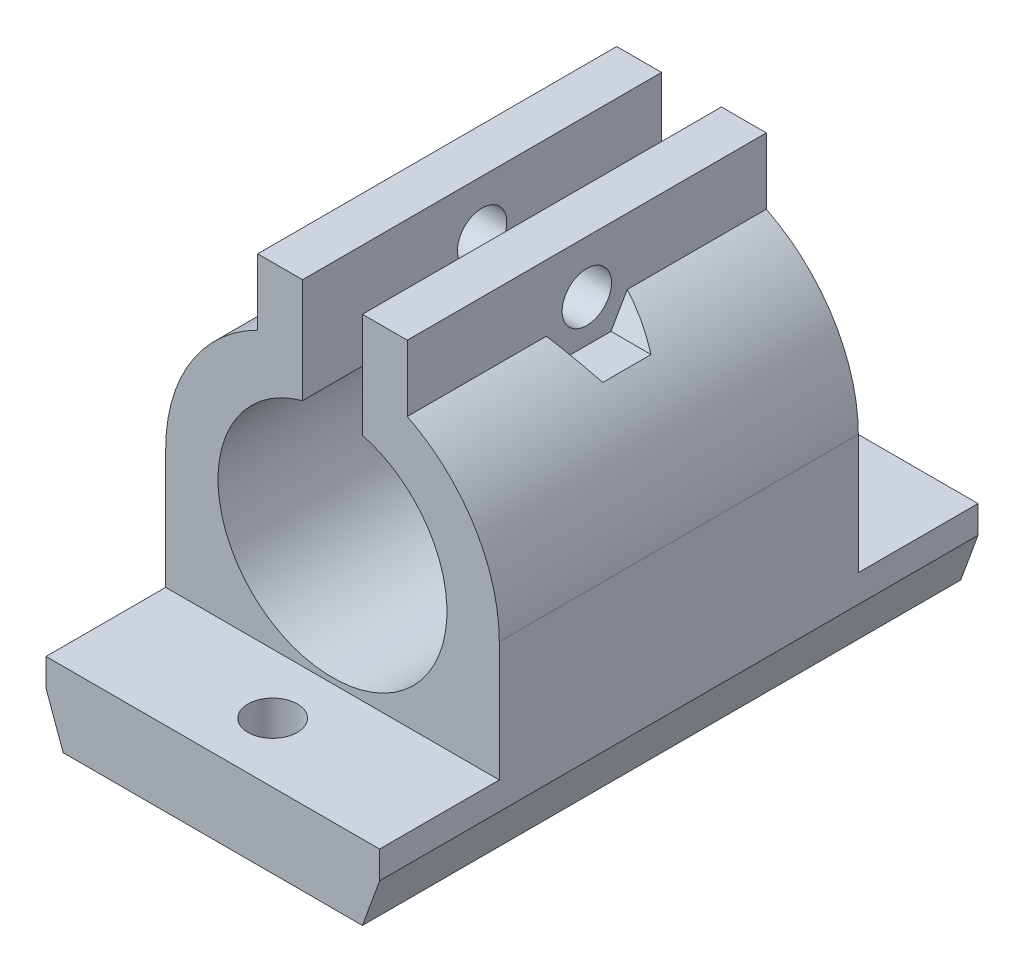
ISO-10303-21;
HEADER;
FILE_DESCRIPTION(('STEP AP214'),'2;1');
FILE_NAME('part.step','',(''),(''),'','','');
FILE_SCHEMA(('AUTOMOTIVE_DESIGN { 1 0 10303 214 1 1 1 1 }'));
ENDSEC;
DATA;
#1=APPLICATION_CONTEXT('core data for automotive mechanical design processes');
#2=APPLICATION_PROTOCOL_DEFINITION('international standard','automotive_design',2000,#1);
#3=PRODUCT_CONTEXT('',#1,'mechanical');
#4=PRODUCT('Part','Part','',(#3));
#5=PRODUCT_RELATED_PRODUCT_CATEGORY('part','',(#4));
#6=PRODUCT_DEFINITION_FORMATION('','',#4);
#7=PRODUCT_DEFINITION_CONTEXT('part definition',#1,'design');
#8=PRODUCT_DEFINITION('design','',#6,#7);
#9=PRODUCT_DEFINITION_SHAPE('','',#8);
#10=(LENGTH_UNIT() NAMED_UNIT(*) SI_UNIT(.MILLI.,.METRE.));
#11=(NAMED_UNIT(*) PLANE_ANGLE_UNIT() SI_UNIT($,.RADIAN.));
#12=(NAMED_UNIT(*) SI_UNIT($,.STERADIAN.) SOLID_ANGLE_UNIT());
#13=UNCERTAINTY_MEASURE_WITH_UNIT(LENGTH_MEASURE(1.E-05),#10,'distance_accuracy_value','');
#14=(GEOMETRIC_REPRESENTATION_CONTEXT(3) GLOBAL_UNCERTAINTY_ASSIGNED_CONTEXT((#13)) GLOBAL_UNIT_ASSIGNED_CONTEXT((#10,
#11,#12)) REPRESENTATION_CONTEXT('',''));
#15=CARTESIAN_POINT('',(0.,0.,0.));
#16=DIRECTION('',(0.,0.,1.));
#17=DIRECTION('',(1.,0.,0.));
#18=AXIS2_PLACEMENT_3D('',#15,#16,#17);
#19=CARTESIAN_POINT('',(0.,0.,40.));
#20=DIRECTION('',(0.,0.,-1.));
#21=DIRECTION('',(-1.,0.,0.));
#22=AXIS2_PLACEMENT_3D('',#19,#20,#21);
#23=CYLINDRICAL_SURFACE('',#22,11.15);
#24=CARTESIAN_POINT('',(0.,0.,23.0506814477178));
#25=DIRECTION('',(0.,0.5,0.866025403784439));
#26=DIRECTION('',(0.,0.866025403784439,-0.5));
#27=AXIS2_PLACEMENT_3D('',#24,#25,#26);
#28=ELLIPSE('',#27,12.8749110029287,11.15);
#29=CARTESIAN_POINT('',(7.67935483154562,8.08393526515502,18.383419246269));
#30=VERTEX_POINT('',#29);
#31=CARTESIAN_POINT('',(5.,9.96606742903138,17.2967697348046));
#32=VERTEX_POINT('',#31);
#33=EDGE_CURVE('E216',#30,#32,#28,.T.);
#34=ORIENTED_EDGE('',*,*,#33,.F.);
#35=DIRECTION('',(0.,0.,-1.));
#36=VECTOR('',#35,1.);
#37=CARTESIAN_POINT('',(7.67935483154562,8.08393526515502,40.));
#38=LINE('',#37,#36);
#39=CARTESIAN_POINT('',(7.67935483154562,8.08393526515502,21.616580753731));
#40=VERTEX_POINT('',#39);
#41=EDGE_CURVE('E367',#40,#30,#38,.T.);
#42=ORIENTED_EDGE('',*,*,#41,.F.);
#43=CARTESIAN_POINT('',(0.,0.,16.9493185522822));
#44=DIRECTION('',(0.,0.5,-0.866025403784439));
#45=DIRECTION('',(0.,-0.866025403784439,-0.5));
#46=AXIS2_PLACEMENT_3D('',#43,#44,#45);
#47=ELLIPSE('',#46,12.8749110029287,11.15);
#48=CARTESIAN_POINT('',(5.,9.96606742903137,22.7032302651954));
#49=VERTEX_POINT('',#48);
#50=EDGE_CURVE('E190',#49,#40,#47,.T.);
#51=ORIENTED_EDGE('',*,*,#50,.F.);
#52=DIRECTION('',(0.,0.,-1.));
#53=VECTOR('',#52,1.);
#54=CARTESIAN_POINT('',(5.,9.96606742903138,40.));
#55=LINE('',#54,#53);
#56=CARTESIAN_POINT('',(5.,9.96606742903138,32.));
#57=VERTEX_POINT('',#56);
#58=EDGE_CURVE('E206',#57,#49,#55,.T.);
#59=ORIENTED_EDGE('',*,*,#58,.F.);
#60=CARTESIAN_POINT('',(0.,0.,32.));
#61=DIRECTION('',(0.,0.,-1.));
#62=DIRECTION('',(-1.,0.,0.));
#63=AXIS2_PLACEMENT_3D('',#60,#61,#62);
#64=CIRCLE('',#63,11.15);
#65=CARTESIAN_POINT('',(11.15,0.,32.));
#66=VERTEX_POINT('',#65);
#67=EDGE_CURVE('E270',#57,#66,#64,.T.);
#68=ORIENTED_EDGE('',*,*,#67,.T.);
#69=DIRECTION('',(0.,0.,-1.));
#70=VECTOR('',#69,1.);
#71=CARTESIAN_POINT('',(11.15,0.,40.));
#72=LINE('',#71,#70);
#73=CARTESIAN_POINT('',(11.15,0.,8.));
#74=VERTEX_POINT('',#73);
#75=EDGE_CURVE('E338',#66,#74,#72,.T.);
#76=ORIENTED_EDGE('',*,*,#75,.T.);
#77=CARTESIAN_POINT('',(0.,0.,8.));
#78=DIRECTION('',(0.,0.,1.));
#79=DIRECTION('',(1.,0.,0.));
#80=AXIS2_PLACEMENT_3D('',#77,#78,#79);
#81=CIRCLE('',#80,11.15);
#82=CARTESIAN_POINT('',(5.,9.96606742903138,8.));
#83=VERTEX_POINT('',#82);
#84=EDGE_CURVE('E309',#74,#83,#81,.T.);
#85=ORIENTED_EDGE('',*,*,#84,.T.);
#86=EDGE_CURVE('E336',#32,#83,#55,.T.);
#87=ORIENTED_EDGE('',*,*,#86,.F.);
#88=EDGE_LOOP('',(#34,#42,#51,#59,#68,#76,#85,#87));
#89=FACE_BOUND('',#88,.T.);
#90=ADVANCED_FACE('F35',(#89),#23,.T.);
#91=CARTESIAN_POINT('',(11.15,10.883935265155,20.));
#92=DIRECTION('',(-1.,0.,0.));
#93=DIRECTION('',(0.,-1.,0.));
#94=AXIS2_PLACEMENT_3D('',#91,#92,#93);
#95=CYLINDRICAL_SURFACE('',#94,1.65);
#96=CARTESIAN_POINT('',(2.,10.883935265155,20.));
#97=DIRECTION('',(1.,0.,0.));
#98=DIRECTION('',(0.,1.,0.));
#99=AXIS2_PLACEMENT_3D('',#96,#97,#98);
#100=CIRCLE('',#99,1.65);
#101=CARTESIAN_POINT('',(2.,12.533935265155,20.));
#102=VERTEX_POINT('',#101);
#103=EDGE_CURVE('E221',#102,#102,#100,.T.);
#104=ORIENTED_EDGE('',*,*,#103,.F.);
#105=EDGE_LOOP('',(#104));
#106=FACE_BOUND('',#105,.T.);
#107=CARTESIAN_POINT('',(5.,10.883935265155,20.));
#108=DIRECTION('',(-1.,0.,0.));
#109=DIRECTION('',(0.,-1.,0.));
#110=AXIS2_PLACEMENT_3D('',#107,#108,#109);
#111=CIRCLE('',#110,1.65);
#112=CARTESIAN_POINT('',(5.,9.23393526515502,20.));
#113=VERTEX_POINT('',#112);
#114=EDGE_CURVE('E222',#113,#113,#111,.T.);
#115=ORIENTED_EDGE('',*,*,#114,.F.);
#116=EDGE_LOOP('',(#115));
#117=FACE_BOUND('',#116,.T.);
#118=ADVANCED_FACE('F387',(#106,#117),#95,.F.);
#119=CARTESIAN_POINT('',(0.,0.,40.));
#120=DIRECTION('',(0.,0.,-1.));
#121=DIRECTION('',(-1.,0.,0.));
#122=AXIS2_PLACEMENT_3D('',#119,#120,#121);
#123=CYLINDRICAL_SURFACE('',#122,11.15);
#124=CARTESIAN_POINT('',(-5.,9.96606742903137,16.6224981664832));
#125=CARTESIAN_POINT('',(-5.08310866278874,9.92437246531158,16.6338325963962));
#126=CARTESIAN_POINT('',(-5.16557189573126,9.88169783842579,16.6462553228296));
#127=CARTESIAN_POINT('',(-5.32911260638789,9.79447041665441,16.6735664164417));
#128=CARTESIAN_POINT('',(-5.41018970124653,9.749917114286,16.6884554530618));
#129=CARTESIAN_POINT('',(-5.651747844665,9.61324743530427,16.7373705175824));
#130=CARTESIAN_POINT('',(-5.8099164931625,9.51844244361273,16.7755620336782));
#131=CARTESIAN_POINT('',(-6.12067918606963,9.3216980179743,16.8661049515654));
#132=CARTESIAN_POINT('',(-6.27317243076615,9.21968109200526,16.918636144546));
#133=CARTESIAN_POINT('',(-6.56830375008214,9.0117886754121,17.0403482345293));
#134=CARTESIAN_POINT('',(-6.71096014388066,8.90592095069628,17.109497044244));
#135=CARTESIAN_POINT('',(-6.92137404642879,8.74218809737574,17.2308827791787));
#136=CARTESIAN_POINT('',(-6.99338189429195,8.68465833495377,17.2762531504682));
#137=CARTESIAN_POINT('',(-7.13349946185656,8.56994172272736,17.3730095506435));
#138=CARTESIAN_POINT('',(-7.20160908254106,8.51275488166628,17.4243957322331));
#139=CARTESIAN_POINT('',(-7.3989550707095,8.34312728037365,17.5877797940329));
#140=CARTESIAN_POINT('',(-7.52186962425827,8.23209927519968,17.7093733078478));
#141=CARTESIAN_POINT('',(-7.69090264635778,8.07333291781052,17.9124042276525));
#142=CARTESIAN_POINT('',(-7.74500836434953,8.02137693164693,17.9840872786394));
#143=CARTESIAN_POINT('',(-7.84723315650273,7.9213958633832,18.1341300905407));
#144=CARTESIAN_POINT('',(-7.89535586332017,7.87336840215301,18.2124857509194));
#145=CARTESIAN_POINT('',(-7.98512233182049,7.7823146650177,18.3755991831763));
#146=CARTESIAN_POINT('',(-8.02676452747976,7.73928959858079,18.4603584951769));
#147=CARTESIAN_POINT('',(-8.10308163001893,7.65934874835333,18.6356991159187));
#148=CARTESIAN_POINT('',(-8.13775813648679,7.62243156230463,18.7262790816951));
#149=CARTESIAN_POINT('',(-8.19517641980227,7.5606278434305,18.8987530565068));
#150=CARTESIAN_POINT('',(-8.21892328313682,7.53477054408974,18.9799664982474));
#151=CARTESIAN_POINT('',(-8.2608415251601,7.48878934928132,19.1453937941629));
#152=CARTESIAN_POINT('',(-8.27901389766838,7.46866443189104,19.229607110529));
#153=CARTESIAN_POINT('',(-8.30961042749613,7.43460846341728,19.4002471597477));
#154=CARTESIAN_POINT('',(-8.32203860344173,7.4206730824161,19.4866723004044));
#155=CARTESIAN_POINT('',(-8.34105458711424,7.39929066008352,19.6609244709321));
#156=CARTESIAN_POINT('',(-8.34764308865344,7.39184284796527,19.7487513330019));
#157=CARTESIAN_POINT('',(-8.35752971902414,7.38067490600799,19.9885491897556));
#158=CARTESIAN_POINT('',(-8.35503976203957,7.38350365522149,20.141157251687));
#159=CARTESIAN_POINT('',(-8.33260598466649,7.40880784278291,20.44328792037));
#160=CARTESIAN_POINT('',(-8.31266849547325,7.43127615450894,20.5928116262002));
#161=CARTESIAN_POINT('',(-8.25658745102605,7.49352734875731,20.8811105405426));
#162=CARTESIAN_POINT('',(-8.22084572516588,7.53288023969393,21.0200578775929));
#163=CARTESIAN_POINT('',(-8.13417145467477,7.62638798374988,21.2878363063442));
#164=CARTESIAN_POINT('',(-8.08323439208324,7.68054723877753,21.416664374917));
#165=CARTESIAN_POINT('',(-7.96356483092297,7.80461540179767,21.6700271344082));
#166=CARTESIAN_POINT('',(-7.89387622198554,7.87533058144917,21.793710544369));
#167=CARTESIAN_POINT('',(-7.7404358793157,8.02618774666035,22.0254401243444));
#168=CARTESIAN_POINT('',(-7.65668801976162,8.10632713346092,22.1334905869564));
#169=CARTESIAN_POINT('',(-7.5012274975242,8.24997614244896,22.3067967843454));
#170=CARTESIAN_POINT('',(-7.43233514150196,8.31216205324895,22.3757467312373));
#171=CARTESIAN_POINT('',(-7.28872411698536,8.43837269352462,22.5054766436219));
#172=CARTESIAN_POINT('',(-7.2140031240445,8.50239815011073,22.5662533230431));
#173=CARTESIAN_POINT('',(-7.05902117909676,8.63150909723444,22.6803059832815));
#174=CARTESIAN_POINT('',(-6.97873227957607,8.69659846125712,22.7335393247436));
#175=CARTESIAN_POINT('',(-6.81358346669155,8.82658693303661,22.8326665731176));
#176=CARTESIAN_POINT('',(-6.72872214171465,8.89148597544082,22.8785581959148));
#177=CARTESIAN_POINT('',(-6.51705625741624,9.04845716080127,22.9821681828039));
#178=CARTESIAN_POINT('',(-6.38811566036819,9.14002191499977,23.0363021294822));
#179=CARTESIAN_POINT('',(-6.12328533272571,9.31952426858893,23.132570542018));
#180=CARTESIAN_POINT('',(-5.98738851671422,9.40745799797048,23.1746924738881));
#181=CARTESIAN_POINT('',(-5.7119872501004,9.57713084652649,23.2481841726981));
#182=CARTESIAN_POINT('',(-5.57256766156458,9.65894317872441,23.2797059554252));
#183=CARTESIAN_POINT('',(-5.28939399121453,9.81688256670659,23.334410093655));
#184=CARTESIAN_POINT('',(-5.14565122342845,9.8930229102414,23.3576124591355));
#185=CARTESIAN_POINT('',(-5.,9.96606742903138,23.3775018335168));
#186=B_SPLINE_CURVE_WITH_KNOTS('',3,(#124,#125,#126,#127,#128,#129,#130,#131,#132,#133,#134,
#135,#136,#137,#138,#139,#140,#141,#142,#143,#144,#145,#146,#147,#148,#149,#150,#151,#152,#153,
#154,#155,#156,#157,#158,#159,#160,#161,#162,#163,#164,#165,#166,#167,#168,#169,#170,#171,#172,
#173,#174,#175,#176,#177,#178,#179,#180,#181,#182,#183,#184,#185),.UNSPECIFIED.,.F.,.F.,(4,2,2,
2,2,2,2,2,2,2,2,2,2,2,2,2,2,2,2,2,2,2,2,2,2,2,2,2,2,2,4),(0.,0.280981264082069,
0.562038921497028,1.12630926232052,1.69800803092943,2.2686116414902,2.57656500720541,
2.88452619162499,3.49771549349568,3.80861681851086,4.11932844456716,4.43011503827389,
4.7408301817296,5.00586915231645,5.27086084428876,5.53566686704629,5.80044142395596,
6.25592696934929,6.71124730096438,7.15560281234625,7.60009057384152,8.07405497985787,
8.54788899360583,8.89429472807623,9.24083932161633,9.58927068670619,9.93781024389224,
10.4385237970627,10.9397579259739,11.4334624090174,11.925971333113),.UNSPECIFIED.);
#187=CARTESIAN_POINT('',(-4.99999999999999,9.96606742903138,16.6224981664832));
#188=VERTEX_POINT('',#187);
#189=CARTESIAN_POINT('',(-4.99999999999999,9.96606742903138,23.3775018335168));
#190=VERTEX_POINT('',#189);
#191=EDGE_CURVE('E358',#188,#190,#186,.T.);
#192=ORIENTED_EDGE('',*,*,#191,.F.);
#193=DIRECTION('',(0.,0.,-1.));
#194=VECTOR('',#193,1.);
#195=CARTESIAN_POINT('',(-5.,9.96606742903137,40.));
#196=LINE('',#195,#194);
#197=CARTESIAN_POINT('',(-5.,9.96606742903137,8.));
#198=VERTEX_POINT('',#197);
#199=EDGE_CURVE('E342',#188,#198,#196,.T.);
#200=ORIENTED_EDGE('',*,*,#199,.T.);
#201=CARTESIAN_POINT('',(0.,0.,8.));
#202=DIRECTION('',(0.,0.,1.));
#203=DIRECTION('',(1.,0.,0.));
#204=AXIS2_PLACEMENT_3D('',#201,#202,#203);
#205=CIRCLE('',#204,11.15);
#206=CARTESIAN_POINT('',(-11.15,0.,8.));
#207=VERTEX_POINT('',#206);
#208=EDGE_CURVE('E312',#198,#207,#205,.T.);
#209=ORIENTED_EDGE('',*,*,#208,.T.);
#210=DIRECTION('',(0.,0.,-1.));
#211=VECTOR('',#210,1.);
#212=CARTESIAN_POINT('',(-11.15,0.,40.));
#213=LINE('',#212,#211);
#214=CARTESIAN_POINT('',(-11.15,0.,32.));
#215=VERTEX_POINT('',#214);
#216=EDGE_CURVE('E340',#215,#207,#213,.T.);
#217=ORIENTED_EDGE('',*,*,#216,.F.);
#218=CARTESIAN_POINT('',(0.,0.,32.));
#219=DIRECTION('',(0.,0.,-1.));
#220=DIRECTION('',(-1.,0.,0.));
#221=AXIS2_PLACEMENT_3D('',#218,#219,#220);
#222=CIRCLE('',#221,11.15);
#223=CARTESIAN_POINT('',(-5.,9.96606742903137,32.));
#224=VERTEX_POINT('',#223);
#225=EDGE_CURVE('E273',#215,#224,#222,.T.);
#226=ORIENTED_EDGE('',*,*,#225,.T.);
#227=EDGE_CURVE('E343',#224,#190,#196,.T.);
#228=ORIENTED_EDGE('',*,*,#227,.T.);
#229=EDGE_LOOP('',(#192,#200,#209,#217,#226,#228));
#230=FACE_BOUND('',#229,.T.);
#231=ADVANCED_FACE('F369',(#230),#123,.T.);
#232=CARTESIAN_POINT('',(-2.,10.883935265155,20.));
#233=DIRECTION('',(-1.,0.,0.));
#234=DIRECTION('',(0.,-1.,0.));
#235=AXIS2_PLACEMENT_3D('',#232,#233,#234);
#236=CIRCLE('',#235,1.65);
#237=CARTESIAN_POINT('',(-2.,9.23393526515503,20.));
#238=VERTEX_POINT('',#237);
#239=EDGE_CURVE('E228',#238,#238,#236,.T.);
#240=ORIENTED_EDGE('',*,*,#239,.F.);
#241=EDGE_LOOP('',(#240));
#242=FACE_BOUND('',#241,.T.);
#243=CARTESIAN_POINT('',(-5.,10.883935265155,20.));
#244=DIRECTION('',(1.,0.,0.));
#245=DIRECTION('',(0.,1.,0.));
#246=AXIS2_PLACEMENT_3D('',#243,#244,#245);
#247=CIRCLE('',#246,1.65);
#248=CARTESIAN_POINT('',(-5.,12.533935265155,20.));
#249=VERTEX_POINT('',#248);
#250=EDGE_CURVE('E225',#249,#249,#247,.T.);
#251=ORIENTED_EDGE('',*,*,#250,.F.);
#252=EDGE_LOOP('',(#251));
#253=FACE_BOUND('',#252,.T.);
#254=ADVANCED_FACE('F382',(#242,#253),#95,.F.);
#255=CARTESIAN_POINT('',(0.,0.,40.));
#256=DIRECTION('',(0.,0.,1.));
#257=DIRECTION('',(1.,0.,0.));
#258=AXIS2_PLACEMENT_3D('',#255,#256,#257);
#259=PLANE('',#258);
#260=DIRECTION('',(1.,0.,0.));
#261=VECTOR('',#260,1.);
#262=CARTESIAN_POINT('',(11.15,-13.,40.));
#263=LINE('',#262,#261);
#264=CARTESIAN_POINT('',(-10.,-13.,40.));
#265=VERTEX_POINT('',#264);
#266=CARTESIAN_POINT('',(10.,-13.,40.));
#267=VERTEX_POINT('',#266);
#268=EDGE_CURVE('E321',#265,#267,#263,.T.);
#269=ORIENTED_EDGE('',*,*,#268,.T.);
#270=DIRECTION('',(-0.342020143325669,-0.939692620785908,0.));
#271=VECTOR('',#270,1.);
#272=CARTESIAN_POINT('',(13.0083416785574,-4.73464916815934,40.));
#273=LINE('',#272,#271);
#274=CARTESIAN_POINT('',(11.15,-9.84040096762718,40.));
#275=VERTEX_POINT('',#274);
#276=EDGE_CURVE('E43',#267,#275,#273,.F.);
#277=ORIENTED_EDGE('',*,*,#276,.T.);
#278=DIRECTION('',(0.,1.,0.));
#279=VECTOR('',#278,1.);
#280=CARTESIAN_POINT('',(11.15,-13.,40.));
#281=LINE('',#280,#279);
#282=CARTESIAN_POINT('',(11.15,-8.,40.));
#283=VERTEX_POINT('',#282);
#284=EDGE_CURVE('E324',#275,#283,#281,.T.);
#285=ORIENTED_EDGE('',*,*,#284,.T.);
#286=DIRECTION('',(-1.,0.,0.));
#287=VECTOR('',#286,1.);
#288=CARTESIAN_POINT('',(-11.15,-8.,40.));
#289=LINE('',#288,#287);
#290=CARTESIAN_POINT('',(-11.15,-8.,40.));
#291=VERTEX_POINT('',#290);
#292=EDGE_CURVE('E253',#283,#291,#289,.T.);
#293=ORIENTED_EDGE('',*,*,#292,.T.);
#294=DIRECTION('',(0.,-1.,0.));
#295=VECTOR('',#294,1.);
#296=CARTESIAN_POINT('',(-11.15,-13.,40.));
#297=LINE('',#296,#295);
#298=CARTESIAN_POINT('',(-11.15,-9.84040096762718,40.));
#299=VERTEX_POINT('',#298);
#300=EDGE_CURVE('E319',#291,#299,#297,.T.);
#301=ORIENTED_EDGE('',*,*,#300,.T.);
#302=DIRECTION('',(-0.342020143325669,0.939692620785908,0.));
#303=VECTOR('',#302,1.);
#304=CARTESIAN_POINT('',(-13.0083416785574,-4.73464916815934,40.));
#305=LINE('',#304,#303);
#306=EDGE_CURVE('E455',#299,#265,#305,.F.);
#307=ORIENTED_EDGE('',*,*,#306,.T.);
#308=EDGE_LOOP('',(#269,#277,#285,#293,#301,#307));
#309=FACE_BOUND('',#308,.T.);
#310=ADVANCED_FACE('F385',(#309),#259,.T.);
#311=CARTESIAN_POINT('',(0.,0.,0.));
#312=DIRECTION('',(0.,0.,1.));
#313=DIRECTION('',(1.,0.,0.));
#314=AXIS2_PLACEMENT_3D('',#311,#312,#313);
#315=PLANE('',#314);
#316=DIRECTION('',(0.,1.,0.));
#317=VECTOR('',#316,1.);
#318=CARTESIAN_POINT('',(11.15,-13.,0.));
#319=LINE('',#318,#317);
#320=CARTESIAN_POINT('',(11.15,-9.84040096762718,0.));
#321=VERTEX_POINT('',#320);
#322=CARTESIAN_POINT('',(11.15,-8.,0.));
#323=VERTEX_POINT('',#322);
#324=EDGE_CURVE('E322',#321,#323,#319,.T.);
#325=ORIENTED_EDGE('',*,*,#324,.F.);
#326=DIRECTION('',(0.342020143325669,0.939692620785908,0.));
#327=VECTOR('',#326,1.);
#328=CARTESIAN_POINT('',(11.15,-9.84040096762718,0.));
#329=LINE('',#328,#327);
#330=CARTESIAN_POINT('',(10.,-13.,0.));
#331=VERTEX_POINT('',#330);
#332=EDGE_CURVE('E461',#321,#331,#329,.F.);
#333=ORIENTED_EDGE('',*,*,#332,.T.);
#334=DIRECTION('',(1.,0.,0.));
#335=VECTOR('',#334,1.);
#336=CARTESIAN_POINT('',(11.15,-13.,0.));
#337=LINE('',#336,#335);
#338=CARTESIAN_POINT('',(-10.,-13.,0.));
#339=VERTEX_POINT('',#338);
#340=EDGE_CURVE('E328',#339,#331,#337,.T.);
#341=ORIENTED_EDGE('',*,*,#340,.F.);
#342=DIRECTION('',(0.342020143325669,-0.939692620785908,0.));
#343=VECTOR('',#342,1.);
#344=CARTESIAN_POINT('',(-10.,-13.,0.));
#345=LINE('',#344,#343);
#346=CARTESIAN_POINT('',(-11.15,-9.84040096762718,0.));
#347=VERTEX_POINT('',#346);
#348=EDGE_CURVE('E453',#339,#347,#345,.F.);
#349=ORIENTED_EDGE('',*,*,#348,.T.);
#350=DIRECTION('',(0.,-1.,0.));
#351=VECTOR('',#350,1.);
#352=CARTESIAN_POINT('',(-11.15,-13.,0.));
#353=LINE('',#352,#351);
#354=CARTESIAN_POINT('',(-11.15,-8.,0.));
#355=VERTEX_POINT('',#354);
#356=EDGE_CURVE('E318',#355,#347,#353,.T.);
#357=ORIENTED_EDGE('',*,*,#356,.F.);
#358=DIRECTION('',(1.,0.,0.));
#359=VECTOR('',#358,1.);
#360=CARTESIAN_POINT('',(-11.15,-8.,0.));
#361=LINE('',#360,#359);
#362=EDGE_CURVE('E289',#355,#323,#361,.T.);
#363=ORIENTED_EDGE('',*,*,#362,.T.);
#364=EDGE_LOOP('',(#325,#333,#341,#349,#357,#363));
#365=FACE_BOUND('',#364,.T.);
#366=ADVANCED_FACE('F414',(#365),#315,.F.);
#367=CARTESIAN_POINT('',(0.,0.,40.));
#368=DIRECTION('',(0.,0.,-1.));
#369=DIRECTION('',(-1.,0.,0.));
#370=AXIS2_PLACEMENT_3D('',#367,#368,#369);
#371=CYLINDRICAL_SURFACE('',#370,7.65);
#372=DIRECTION('',(0.,0.,-1.));
#373=VECTOR('',#372,1.);
#374=CARTESIAN_POINT('',(-2.,7.38393526515503,40.));
#375=LINE('',#374,#373);
#376=CARTESIAN_POINT('',(-2.,7.38393526515503,32.));
#377=VERTEX_POINT('',#376);
#378=CARTESIAN_POINT('',(-2.,7.38393526515503,8.));
#379=VERTEX_POINT('',#378);
#380=EDGE_CURVE('E350',#377,#379,#375,.T.);
#381=ORIENTED_EDGE('',*,*,#380,.F.);
#382=CARTESIAN_POINT('',(0.,0.,32.));
#383=DIRECTION('',(0.,0.,-1.));
#384=DIRECTION('',(-1.,0.,0.));
#385=AXIS2_PLACEMENT_3D('',#382,#383,#384);
#386=CIRCLE('',#385,7.65);
#387=CARTESIAN_POINT('',(2.,7.38393526515503,32.));
#388=VERTEX_POINT('',#387);
#389=EDGE_CURVE('E262',#377,#388,#386,.F.);
#390=ORIENTED_EDGE('',*,*,#389,.T.);
#391=DIRECTION('',(0.,0.,-1.));
#392=VECTOR('',#391,1.);
#393=CARTESIAN_POINT('',(2.,7.38393526515503,40.));
#394=LINE('',#393,#392);
#395=CARTESIAN_POINT('',(2.,7.38393526515503,8.));
#396=VERTEX_POINT('',#395);
#397=EDGE_CURVE('E326',#388,#396,#394,.T.);
#398=ORIENTED_EDGE('',*,*,#397,.T.);
#399=CARTESIAN_POINT('',(0.,0.,8.));
#400=DIRECTION('',(0.,0.,1.));
#401=DIRECTION('',(1.,0.,0.));
#402=AXIS2_PLACEMENT_3D('',#399,#400,#401);
#403=CIRCLE('',#402,7.65);
#404=EDGE_CURVE('E300',#396,#379,#403,.F.);
#405=ORIENTED_EDGE('',*,*,#404,.T.);
#406=EDGE_LOOP('',(#381,#390,#398,#405));
#407=FACE_BOUND('',#406,.T.);
#408=ADVANCED_FACE('F418',(#407),#371,.F.);
#409=CARTESIAN_POINT('',(-2.,7.38393526515503,40.));
#410=DIRECTION('',(-1.,0.,0.));
#411=DIRECTION('',(0.,-1.,0.));
#412=AXIS2_PLACEMENT_3D('',#409,#410,#411);
#413=PLANE('',#412);
#414=ORIENTED_EDGE('',*,*,#239,.T.);
#415=EDGE_LOOP('',(#414));
#416=FACE_BOUND('',#415,.T.);
#417=DIRECTION('',(0.,0.,-1.));
#418=VECTOR('',#417,1.);
#419=CARTESIAN_POINT('',(-2.,14.383935265155,40.));
#420=LINE('',#419,#418);
#421=CARTESIAN_POINT('',(-2.,14.383935265155,32.));
#422=VERTEX_POINT('',#421);
#423=CARTESIAN_POINT('',(-2.,14.383935265155,8.));
#424=VERTEX_POINT('',#423);
#425=EDGE_CURVE('E348',#422,#424,#420,.T.);
#426=ORIENTED_EDGE('',*,*,#425,.F.);
#427=DIRECTION('',(0.,-1.,0.));
#428=VECTOR('',#427,1.);
#429=CARTESIAN_POINT('',(-2.,7.38393526515503,32.));
#430=LINE('',#429,#428);
#431=EDGE_CURVE('E265',#422,#377,#430,.T.);
#432=ORIENTED_EDGE('',*,*,#431,.T.);
#433=ORIENTED_EDGE('',*,*,#380,.T.);
#434=DIRECTION('',(0.,1.,0.));
#435=VECTOR('',#434,1.);
#436=CARTESIAN_POINT('',(-2.,7.38393526515503,8.));
#437=LINE('',#436,#435);
#438=EDGE_CURVE('E303',#379,#424,#437,.T.);
#439=ORIENTED_EDGE('',*,*,#438,.T.);
#440=EDGE_LOOP('',(#426,#432,#433,#439));
#441=FACE_BOUND('',#440,.T.);
#442=ADVANCED_FACE('F501',(#416,#441),#413,.F.);
#443=CARTESIAN_POINT('',(-2.,14.383935265155,40.));
#444=DIRECTION('',(0.,-1.,0.));
#445=DIRECTION('',(0.,0.,-1.));
#446=AXIS2_PLACEMENT_3D('',#443,#444,#445);
#447=PLANE('',#446);
#448=DIRECTION('',(0.,0.,-1.));
#449=VECTOR('',#448,1.);
#450=CARTESIAN_POINT('',(-5.,14.383935265155,40.));
#451=LINE('',#450,#449);
#452=CARTESIAN_POINT('',(-5.,14.383935265155,32.));
#453=VERTEX_POINT('',#452);
#454=CARTESIAN_POINT('',(-5.,14.383935265155,8.));
#455=VERTEX_POINT('',#454);
#456=EDGE_CURVE('E346',#453,#455,#451,.T.);
#457=ORIENTED_EDGE('',*,*,#456,.F.);
#458=DIRECTION('',(-1.,0.,0.));
#459=VECTOR('',#458,1.);
#460=CARTESIAN_POINT('',(-11.15,14.383935265155,32.));
#461=LINE('',#460,#459);
#462=EDGE_CURVE('E241',#422,#453,#461,.T.);
#463=ORIENTED_EDGE('',*,*,#462,.F.);
#464=ORIENTED_EDGE('',*,*,#425,.T.);
#465=DIRECTION('',(1.,0.,0.));
#466=VECTOR('',#465,1.);
#467=CARTESIAN_POINT('',(-11.15,14.383935265155,8.));
#468=LINE('',#467,#466);
#469=EDGE_CURVE('E292',#455,#424,#468,.T.);
#470=ORIENTED_EDGE('',*,*,#469,.F.);
#471=EDGE_LOOP('',(#457,#463,#464,#470));
#472=FACE_BOUND('',#471,.T.);
#473=ADVANCED_FACE('F445',(#472),#447,.F.);
#474=CARTESIAN_POINT('',(-5.,14.383935265155,40.));
#475=DIRECTION('',(1.,0.,0.));
#476=DIRECTION('',(0.,1.,0.));
#477=AXIS2_PLACEMENT_3D('',#474,#475,#476);
#478=PLANE('',#477);
#479=ORIENTED_EDGE('',*,*,#456,.T.);
#480=DIRECTION('',(0.,-1.,0.));
#481=VECTOR('',#480,1.);
#482=CARTESIAN_POINT('',(-5.,14.383935265155,8.));
#483=LINE('',#482,#481);
#484=EDGE_CURVE('E315',#455,#198,#483,.T.);
#485=ORIENTED_EDGE('',*,*,#484,.T.);
#486=ORIENTED_EDGE('',*,*,#199,.F.);
#487=CARTESIAN_POINT('',(-4.99999999999999,10.883935265155,20.));
#488=DIRECTION('',(-1.,0.,0.));
#489=DIRECTION('',(0.,-1.,0.));
#490=AXIS2_PLACEMENT_3D('',#487,#488,#489);
#491=CIRCLE('',#490,3.5);
#492=EDGE_CURVE('E218',#188,#190,#491,.T.);
#493=ORIENTED_EDGE('',*,*,#492,.T.);
#494=ORIENTED_EDGE('',*,*,#227,.F.);
#495=DIRECTION('',(0.,1.,0.));
#496=VECTOR('',#495,1.);
#497=CARTESIAN_POINT('',(-5.,14.383935265155,32.));
#498=LINE('',#497,#496);
#499=EDGE_CURVE('E276',#224,#453,#498,.T.);
#500=ORIENTED_EDGE('',*,*,#499,.T.);
#501=EDGE_LOOP('',(#479,#485,#486,#493,#494,#500));
#502=FACE_BOUND('',#501,.T.);
#503=ORIENTED_EDGE('',*,*,#250,.T.);
#504=EDGE_LOOP('',(#503));
#505=FACE_BOUND('',#504,.T.);
#506=ADVANCED_FACE('F441',(#502,#505),#478,.F.);
#507=CARTESIAN_POINT('',(-11.15,-13.,40.));
#508=DIRECTION('',(1.,0.,0.));
#509=DIRECTION('',(0.,0.,-1.));
#510=AXIS2_PLACEMENT_3D('',#507,#508,#509);
#511=PLANE('',#510);
#512=ORIENTED_EDGE('',*,*,#356,.T.);
#513=DIRECTION('',(0.,0.,1.));
#514=VECTOR('',#513,1.);
#515=CARTESIAN_POINT('',(-11.15,-9.84040096762718,40.));
#516=LINE('',#515,#514);
#517=EDGE_CURVE('E12',#347,#299,#516,.T.);
#518=ORIENTED_EDGE('',*,*,#517,.T.);
#519=ORIENTED_EDGE('',*,*,#300,.F.);
#520=DIRECTION('',(0.,0.,-1.));
#521=VECTOR('',#520,1.);
#522=CARTESIAN_POINT('',(-11.15,-8.,32.));
#523=LINE('',#522,#521);
#524=CARTESIAN_POINT('',(-11.15,-8.,32.));
#525=VERTEX_POINT('',#524);
#526=EDGE_CURVE('E250',#291,#525,#523,.T.);
#527=ORIENTED_EDGE('',*,*,#526,.T.);
#528=DIRECTION('',(0.,1.,0.));
#529=VECTOR('',#528,1.);
#530=CARTESIAN_POINT('',(-11.15,-36.6915596785015,32.));
#531=LINE('',#530,#529);
#532=EDGE_CURVE('E248',#525,#215,#531,.T.);
#533=ORIENTED_EDGE('',*,*,#532,.T.);
#534=ORIENTED_EDGE('',*,*,#216,.T.);
#535=DIRECTION('',(0.,1.,0.));
#536=VECTOR('',#535,1.);
#537=CARTESIAN_POINT('',(-11.15,-36.6915596785015,8.));
#538=LINE('',#537,#536);
#539=CARTESIAN_POINT('',(-11.15,-8.,8.));
#540=VERTEX_POINT('',#539);
#541=EDGE_CURVE('E295',#540,#207,#538,.T.);
#542=ORIENTED_EDGE('',*,*,#541,.F.);
#543=DIRECTION('',(0.,0.,-1.));
#544=VECTOR('',#543,1.);
#545=CARTESIAN_POINT('',(-11.15,-8.,0.));
#546=LINE('',#545,#544);
#547=EDGE_CURVE('E280',#540,#355,#546,.T.);
#548=ORIENTED_EDGE('',*,*,#547,.T.);
#549=EDGE_LOOP('',(#512,#518,#519,#527,#533,#534,#542,#548));
#550=FACE_BOUND('',#549,.T.);
#551=ADVANCED_FACE('F438',(#550),#511,.F.);
#552=CARTESIAN_POINT('',(11.15,-13.,40.));
#553=DIRECTION('',(0.,1.,0.));
#554=DIRECTION('',(-1.,0.,0.));
#555=AXIS2_PLACEMENT_3D('',#552,#553,#554);
#556=PLANE('',#555);
#557=CARTESIAN_POINT('',(0.,-13.,36.));
#558=DIRECTION('',(0.,1.,0.));
#559=DIRECTION('',(0.,0.,-1.));
#560=AXIS2_PLACEMENT_3D('',#557,#558,#559);
#561=CIRCLE('',#560,1.65);
#562=CARTESIAN_POINT('',(0.,-13.,34.35));
#563=VERTEX_POINT('',#562);
#564=EDGE_CURVE('E232',#563,#563,#561,.T.);
#565=ORIENTED_EDGE('',*,*,#564,.T.);
#566=EDGE_LOOP('',(#565));
#567=FACE_BOUND('',#566,.T.);
#568=CARTESIAN_POINT('',(0.,-13.,4.));
#569=DIRECTION('',(0.,1.,0.));
#570=DIRECTION('',(0.,0.,1.));
#571=AXIS2_PLACEMENT_3D('',#568,#569,#570);
#572=CIRCLE('',#571,1.65);
#573=CARTESIAN_POINT('',(0.,-13.,5.65));
#574=VERTEX_POINT('',#573);
#575=EDGE_CURVE('E238',#574,#574,#572,.T.);
#576=ORIENTED_EDGE('',*,*,#575,.T.);
#577=EDGE_LOOP('',(#576));
#578=FACE_BOUND('',#577,.T.);
#579=ORIENTED_EDGE('',*,*,#340,.T.);
#580=DIRECTION('',(0.,0.,1.));
#581=VECTOR('',#580,1.);
#582=CARTESIAN_POINT('',(10.,-13.,40.));
#583=LINE('',#582,#581);
#584=EDGE_CURVE('E56',#331,#267,#583,.T.);
#585=ORIENTED_EDGE('',*,*,#584,.T.);
#586=ORIENTED_EDGE('',*,*,#268,.F.);
#587=DIRECTION('',(0.,0.,-1.));
#588=VECTOR('',#587,1.);
#589=CARTESIAN_POINT('',(-10.,-13.,40.));
#590=LINE('',#589,#588);
#591=EDGE_CURVE('E456',#265,#339,#590,.T.);
#592=ORIENTED_EDGE('',*,*,#591,.T.);
#593=EDGE_LOOP('',(#579,#585,#586,#592));
#594=FACE_BOUND('',#593,.T.);
#595=ADVANCED_FACE('F435',(#567,#578,#594),#556,.F.);
#596=CARTESIAN_POINT('',(11.15,-13.,40.));
#597=DIRECTION('',(-1.,0.,0.));
#598=DIRECTION('',(0.,-1.,0.));
#599=AXIS2_PLACEMENT_3D('',#596,#597,#598);
#600=PLANE('',#599);
#601=ORIENTED_EDGE('',*,*,#284,.F.);
#602=DIRECTION('',(0.,0.,-1.));
#603=VECTOR('',#602,1.);
#604=CARTESIAN_POINT('',(11.15,-9.84040096762718,40.));
#605=LINE('',#604,#603);
#606=EDGE_CURVE('E463',#275,#321,#605,.T.);
#607=ORIENTED_EDGE('',*,*,#606,.T.);
#608=ORIENTED_EDGE('',*,*,#324,.T.);
#609=DIRECTION('',(0.,0.,1.));
#610=VECTOR('',#609,1.);
#611=CARTESIAN_POINT('',(11.15,-8.,0.));
#612=LINE('',#611,#610);
#613=CARTESIAN_POINT('',(11.15,-8.,8.));
#614=VERTEX_POINT('',#613);
#615=EDGE_CURVE('E286',#323,#614,#612,.T.);
#616=ORIENTED_EDGE('',*,*,#615,.T.);
#617=DIRECTION('',(0.,1.,0.));
#618=VECTOR('',#617,1.);
#619=CARTESIAN_POINT('',(11.15,-36.6915596785015,8.));
#620=LINE('',#619,#618);
#621=EDGE_CURVE('E284',#614,#74,#620,.T.);
#622=ORIENTED_EDGE('',*,*,#621,.T.);
#623=ORIENTED_EDGE('',*,*,#75,.F.);
#624=DIRECTION('',(0.,1.,0.));
#625=VECTOR('',#624,1.);
#626=CARTESIAN_POINT('',(11.15,-36.6915596785015,32.));
#627=LINE('',#626,#625);
#628=CARTESIAN_POINT('',(11.15,-8.,32.));
#629=VERTEX_POINT('',#628);
#630=EDGE_CURVE('E258',#629,#66,#627,.T.);
#631=ORIENTED_EDGE('',*,*,#630,.F.);
#632=DIRECTION('',(0.,0.,1.));
#633=VECTOR('',#632,1.);
#634=CARTESIAN_POINT('',(11.15,-8.,32.));
#635=LINE('',#634,#633);
#636=EDGE_CURVE('E244',#629,#283,#635,.T.);
#637=ORIENTED_EDGE('',*,*,#636,.T.);
#638=EDGE_LOOP('',(#601,#607,#608,#616,#622,#623,#631,#637));
#639=FACE_BOUND('',#638,.T.);
#640=ADVANCED_FACE('F429',(#639),#600,.F.);
#641=CARTESIAN_POINT('',(5.,14.383935265155,40.));
#642=DIRECTION('',(-1.,0.,0.));
#643=DIRECTION('',(0.,-1.,0.));
#644=AXIS2_PLACEMENT_3D('',#641,#642,#643);
#645=PLANE('',#644);
#646=DIRECTION('',(0.,0.866025403784439,-0.5));
#647=VECTOR('',#646,1.);
#648=CARTESIAN_POINT('',(5.,8.08393526515502,18.383419246269));
#649=LINE('',#648,#647);
#650=CARTESIAN_POINT('',(5.,8.08393526515502,18.383419246269));
#651=VERTEX_POINT('',#650);
#652=EDGE_CURVE('E207',#651,#32,#649,.T.);
#653=ORIENTED_EDGE('',*,*,#652,.T.);
#654=ORIENTED_EDGE('',*,*,#86,.T.);
#655=DIRECTION('',(0.,1.,0.));
#656=VECTOR('',#655,1.);
#657=CARTESIAN_POINT('',(5.,14.383935265155,8.));
#658=LINE('',#657,#656);
#659=CARTESIAN_POINT('',(5.,14.383935265155,8.));
#660=VERTEX_POINT('',#659);
#661=EDGE_CURVE('E306',#83,#660,#658,.T.);
#662=ORIENTED_EDGE('',*,*,#661,.T.);
#663=DIRECTION('',(0.,0.,-1.));
#664=VECTOR('',#663,1.);
#665=CARTESIAN_POINT('',(5.,14.383935265155,40.));
#666=LINE('',#665,#664);
#667=CARTESIAN_POINT('',(5.,14.383935265155,32.));
#668=VERTEX_POINT('',#667);
#669=EDGE_CURVE('E334',#668,#660,#666,.T.);
#670=ORIENTED_EDGE('',*,*,#669,.F.);
#671=DIRECTION('',(0.,-1.,0.));
#672=VECTOR('',#671,1.);
#673=CARTESIAN_POINT('',(5.,14.383935265155,32.));
#674=LINE('',#673,#672);
#675=EDGE_CURVE('E268',#668,#57,#674,.T.);
#676=ORIENTED_EDGE('',*,*,#675,.T.);
#677=ORIENTED_EDGE('',*,*,#58,.T.);
#678=DIRECTION('',(0.,-0.866025403784438,-0.5));
#679=VECTOR('',#678,1.);
#680=CARTESIAN_POINT('',(5.,10.883935265155,23.2331615074619));
#681=LINE('',#680,#679);
#682=CARTESIAN_POINT('',(5.,8.08393526515502,21.616580753731));
#683=VERTEX_POINT('',#682);
#684=EDGE_CURVE('E188',#49,#683,#681,.T.);
#685=ORIENTED_EDGE('',*,*,#684,.T.);
#686=DIRECTION('',(0.,0.,-1.));
#687=VECTOR('',#686,1.);
#688=CARTESIAN_POINT('',(5.,8.08393526515502,21.616580753731));
#689=LINE('',#688,#687);
#690=EDGE_CURVE('E202',#683,#651,#689,.T.);
#691=ORIENTED_EDGE('',*,*,#690,.T.);
#692=EDGE_LOOP('',(#653,#654,#662,#670,#676,#677,#685,#691));
#693=FACE_BOUND('',#692,.T.);
#694=ORIENTED_EDGE('',*,*,#114,.T.);
#695=EDGE_LOOP('',(#694));
#696=FACE_BOUND('',#695,.T.);
#697=ADVANCED_FACE('F200',(#693,#696),#645,.F.);
#698=CARTESIAN_POINT('',(2.,14.383935265155,40.));
#699=DIRECTION('',(0.,-1.,0.));
#700=DIRECTION('',(0.,0.,-1.));
#701=AXIS2_PLACEMENT_3D('',#698,#699,#700);
#702=PLANE('',#701);
#703=DIRECTION('',(0.,0.,-1.));
#704=VECTOR('',#703,1.);
#705=CARTESIAN_POINT('',(2.,14.383935265155,40.));
#706=LINE('',#705,#704);
#707=CARTESIAN_POINT('',(2.,14.383935265155,32.));
#708=VERTEX_POINT('',#707);
#709=CARTESIAN_POINT('',(2.,14.383935265155,8.));
#710=VERTEX_POINT('',#709);
#711=EDGE_CURVE('E332',#708,#710,#706,.T.);
#712=ORIENTED_EDGE('',*,*,#711,.F.);
#713=EDGE_CURVE('E255',#668,#708,#461,.T.);
#714=ORIENTED_EDGE('',*,*,#713,.F.);
#715=ORIENTED_EDGE('',*,*,#669,.T.);
#716=EDGE_CURVE('E279',#710,#660,#468,.T.);
#717=ORIENTED_EDGE('',*,*,#716,.F.);
#718=EDGE_LOOP('',(#712,#714,#715,#717));
#719=FACE_BOUND('',#718,.T.);
#720=ADVANCED_FACE('F422',(#719),#702,.F.);
#721=CARTESIAN_POINT('',(2.,7.38393526515503,40.));
#722=DIRECTION('',(1.,0.,0.));
#723=DIRECTION('',(0.,1.,0.));
#724=AXIS2_PLACEMENT_3D('',#721,#722,#723);
#725=PLANE('',#724);
#726=ORIENTED_EDGE('',*,*,#103,.T.);
#727=EDGE_LOOP('',(#726));
#728=FACE_BOUND('',#727,.T.);
#729=ORIENTED_EDGE('',*,*,#397,.F.);
#730=DIRECTION('',(0.,1.,0.));
#731=VECTOR('',#730,1.);
#732=CARTESIAN_POINT('',(2.,7.38393526515503,32.));
#733=LINE('',#732,#731);
#734=EDGE_CURVE('E355',#388,#708,#733,.T.);
#735=ORIENTED_EDGE('',*,*,#734,.T.);
#736=ORIENTED_EDGE('',*,*,#711,.T.);
#737=DIRECTION('',(0.,-1.,0.));
#738=VECTOR('',#737,1.);
#739=CARTESIAN_POINT('',(2.,7.38393526515503,8.));
#740=LINE('',#739,#738);
#741=EDGE_CURVE('E352',#710,#396,#740,.T.);
#742=ORIENTED_EDGE('',*,*,#741,.T.);
#743=EDGE_LOOP('',(#729,#735,#736,#742));
#744=FACE_BOUND('',#743,.T.);
#745=ADVANCED_FACE('F410',(#728,#744),#725,.F.);
#746=CARTESIAN_POINT('',(-11.15,-36.6915596785015,8.));
#747=DIRECTION('',(0.,0.,1.));
#748=DIRECTION('',(1.,0.,0.));
#749=AXIS2_PLACEMENT_3D('',#746,#747,#748);
#750=PLANE('',#749);
#751=ORIENTED_EDGE('',*,*,#469,.T.);
#752=ORIENTED_EDGE('',*,*,#438,.F.);
#753=ORIENTED_EDGE('',*,*,#404,.F.);
#754=ORIENTED_EDGE('',*,*,#741,.F.);
#755=ORIENTED_EDGE('',*,*,#716,.T.);
#756=ORIENTED_EDGE('',*,*,#661,.F.);
#757=ORIENTED_EDGE('',*,*,#84,.F.);
#758=ORIENTED_EDGE('',*,*,#621,.F.);
#759=DIRECTION('',(-1.,0.,0.));
#760=VECTOR('',#759,1.);
#761=CARTESIAN_POINT('',(-11.15,-8.,8.));
#762=LINE('',#761,#760);
#763=EDGE_CURVE('E283',#614,#540,#762,.T.);
#764=ORIENTED_EDGE('',*,*,#763,.T.);
#765=ORIENTED_EDGE('',*,*,#541,.T.);
#766=ORIENTED_EDGE('',*,*,#208,.F.);
#767=ORIENTED_EDGE('',*,*,#484,.F.);
#768=EDGE_LOOP('',(#751,#752,#753,#754,#755,#756,#757,#758,#764,#765,#766,#767));
#769=FACE_BOUND('',#768,.T.);
#770=ADVANCED_FACE('F406',(#769),#750,.F.);
#771=CARTESIAN_POINT('',(11.15,-8.,40.));
#772=DIRECTION('',(0.,1.,0.));
#773=DIRECTION('',(-1.,0.,0.));
#774=AXIS2_PLACEMENT_3D('',#771,#772,#773);
#775=PLANE('',#774);
#776=CARTESIAN_POINT('',(0.,-8.,4.));
#777=DIRECTION('',(0.,1.,0.));
#778=DIRECTION('',(0.,0.,1.));
#779=AXIS2_PLACEMENT_3D('',#776,#777,#778);
#780=CIRCLE('',#779,1.65);
#781=CARTESIAN_POINT('',(0.,-8.,5.65));
#782=VERTEX_POINT('',#781);
#783=EDGE_CURVE('E235',#782,#782,#780,.T.);
#784=ORIENTED_EDGE('',*,*,#783,.F.);
#785=EDGE_LOOP('',(#784));
#786=FACE_BOUND('',#785,.T.);
#787=ORIENTED_EDGE('',*,*,#615,.F.);
#788=ORIENTED_EDGE('',*,*,#362,.F.);
#789=ORIENTED_EDGE('',*,*,#547,.F.);
#790=ORIENTED_EDGE('',*,*,#763,.F.);
#791=EDGE_LOOP('',(#787,#788,#789,#790));
#792=FACE_BOUND('',#791,.T.);
#793=ADVANCED_FACE('F402',(#786,#792),#775,.T.);
#794=CARTESIAN_POINT('',(-11.15,-36.6915596785015,32.));
#795=DIRECTION('',(0.,0.,-1.));
#796=DIRECTION('',(-1.,0.,0.));
#797=AXIS2_PLACEMENT_3D('',#794,#795,#796);
#798=PLANE('',#797);
#799=ORIENTED_EDGE('',*,*,#225,.F.);
#800=ORIENTED_EDGE('',*,*,#532,.F.);
#801=DIRECTION('',(1.,0.,0.));
#802=VECTOR('',#801,1.);
#803=CARTESIAN_POINT('',(-11.15,-8.,32.));
#804=LINE('',#803,#802);
#805=EDGE_CURVE('E247',#525,#629,#804,.T.);
#806=ORIENTED_EDGE('',*,*,#805,.T.);
#807=ORIENTED_EDGE('',*,*,#630,.T.);
#808=ORIENTED_EDGE('',*,*,#67,.F.);
#809=ORIENTED_EDGE('',*,*,#675,.F.);
#810=ORIENTED_EDGE('',*,*,#713,.T.);
#811=ORIENTED_EDGE('',*,*,#734,.F.);
#812=ORIENTED_EDGE('',*,*,#389,.F.);
#813=ORIENTED_EDGE('',*,*,#431,.F.);
#814=ORIENTED_EDGE('',*,*,#462,.T.);
#815=ORIENTED_EDGE('',*,*,#499,.F.);
#816=EDGE_LOOP('',(#799,#800,#806,#807,#808,#809,#810,#811,#812,#813,#814,#815));
#817=FACE_BOUND('',#816,.T.);
#818=ADVANCED_FACE('F398',(#817),#798,.F.);
#819=CARTESIAN_POINT('',(11.15,-8.,40.));
#820=DIRECTION('',(0.,1.,0.));
#821=DIRECTION('',(-1.,0.,0.));
#822=AXIS2_PLACEMENT_3D('',#819,#820,#821);
#823=PLANE('',#822);
#824=CARTESIAN_POINT('',(0.,-8.,36.));
#825=DIRECTION('',(0.,1.,0.));
#826=DIRECTION('',(0.,0.,-1.));
#827=AXIS2_PLACEMENT_3D('',#824,#825,#826);
#828=CIRCLE('',#827,1.65);
#829=CARTESIAN_POINT('',(0.,-8.,34.35));
#830=VERTEX_POINT('',#829);
#831=EDGE_CURVE('E231',#830,#830,#828,.T.);
#832=ORIENTED_EDGE('',*,*,#831,.F.);
#833=EDGE_LOOP('',(#832));
#834=FACE_BOUND('',#833,.T.);
#835=ORIENTED_EDGE('',*,*,#526,.F.);
#836=ORIENTED_EDGE('',*,*,#292,.F.);
#837=ORIENTED_EDGE('',*,*,#636,.F.);
#838=ORIENTED_EDGE('',*,*,#805,.F.);
#839=EDGE_LOOP('',(#835,#836,#837,#838));
#840=FACE_BOUND('',#839,.T.);
#841=ADVANCED_FACE('F394',(#834,#840),#823,.T.);
#842=CARTESIAN_POINT('',(0.,-13.,4.));
#843=DIRECTION('',(0.,1.,0.));
#844=DIRECTION('',(0.,0.,1.));
#845=AXIS2_PLACEMENT_3D('',#842,#843,#844);
#846=CYLINDRICAL_SURFACE('',#845,1.65);
#847=ORIENTED_EDGE('',*,*,#575,.F.);
#848=EDGE_LOOP('',(#847));
#849=FACE_BOUND('',#848,.T.);
#850=ORIENTED_EDGE('',*,*,#783,.T.);
#851=EDGE_LOOP('',(#850));
#852=FACE_BOUND('',#851,.T.);
#853=ADVANCED_FACE('F390',(#849,#852),#846,.F.);
#854=CARTESIAN_POINT('',(0.,-13.,36.));
#855=DIRECTION('',(0.,1.,0.));
#856=DIRECTION('',(0.,0.,1.));
#857=AXIS2_PLACEMENT_3D('',#854,#855,#856);
#858=CYLINDRICAL_SURFACE('',#857,1.65);
#859=ORIENTED_EDGE('',*,*,#564,.F.);
#860=EDGE_LOOP('',(#859));
#861=FACE_BOUND('',#860,.T.);
#862=ORIENTED_EDGE('',*,*,#831,.T.);
#863=EDGE_LOOP('',(#862));
#864=FACE_BOUND('',#863,.T.);
#865=ADVANCED_FACE('F378',(#861,#864),#858,.F.);
#866=CARTESIAN_POINT('',(-15.,10.883935265155,20.));
#867=DIRECTION('',(1.,0.,0.));
#868=DIRECTION('',(0.,1.,0.));
#869=AXIS2_PLACEMENT_3D('',#866,#867,#868);
#870=CYLINDRICAL_SURFACE('',#869,3.5);
#871=ORIENTED_EDGE('',*,*,#191,.T.);
#872=ORIENTED_EDGE('',*,*,#492,.F.);
#873=EDGE_LOOP('',(#871,#872));
#874=FACE_BOUND('',#873,.T.);
#875=ADVANCED_FACE('F373',(#874),#870,.F.);
#876=CARTESIAN_POINT('',(15.,8.08393526515502,21.616580753731));
#877=DIRECTION('',(0.,1.,0.));
#878=DIRECTION('',(-1.,0.,0.));
#879=AXIS2_PLACEMENT_3D('',#876,#877,#878);
#880=PLANE('',#879);
#881=ORIENTED_EDGE('',*,*,#41,.T.);
#882=DIRECTION('',(-1.,0.,0.));
#883=VECTOR('',#882,1.);
#884=CARTESIAN_POINT('',(15.,8.08393526515502,18.383419246269));
#885=LINE('',#884,#883);
#886=EDGE_CURVE('E194',#30,#651,#885,.T.);
#887=ORIENTED_EDGE('',*,*,#886,.T.);
#888=ORIENTED_EDGE('',*,*,#690,.F.);
#889=DIRECTION('',(-1.,0.,0.));
#890=VECTOR('',#889,1.);
#891=CARTESIAN_POINT('',(15.,8.08393526515502,21.616580753731));
#892=LINE('',#891,#890);
#893=EDGE_CURVE('E185',#40,#683,#892,.T.);
#894=ORIENTED_EDGE('',*,*,#893,.F.);
#895=EDGE_LOOP('',(#881,#887,#888,#894));
#896=FACE_BOUND('',#895,.T.);
#897=ADVANCED_FACE('F209',(#896),#880,.T.);
#898=CARTESIAN_POINT('',(15.,8.08393526515502,18.383419246269));
#899=DIRECTION('',(0.,0.5,0.866025403784439));
#900=DIRECTION('',(0.,-0.866025403784439,0.5));
#901=AXIS2_PLACEMENT_3D('',#898,#899,#900);
#902=PLANE('',#901);
#903=ORIENTED_EDGE('',*,*,#33,.T.);
#904=ORIENTED_EDGE('',*,*,#652,.F.);
#905=ORIENTED_EDGE('',*,*,#886,.F.);
#906=EDGE_LOOP('',(#903,#904,#905));
#907=FACE_BOUND('',#906,.T.);
#908=ADVANCED_FACE('F380',(#907),#902,.T.);
#909=CARTESIAN_POINT('',(15.,10.883935265155,23.2331615074619));
#910=DIRECTION('',(0.,0.5,-0.866025403784439));
#911=DIRECTION('',(0.,0.866025403784439,0.5));
#912=AXIS2_PLACEMENT_3D('',#909,#910,#911);
#913=PLANE('',#912);
#914=ORIENTED_EDGE('',*,*,#50,.T.);
#915=ORIENTED_EDGE('',*,*,#893,.T.);
#916=ORIENTED_EDGE('',*,*,#684,.F.);
#917=EDGE_LOOP('',(#914,#915,#916));
#918=FACE_BOUND('',#917,.T.);
#919=ADVANCED_FACE('F187',(#918),#913,.T.);
#920=CARTESIAN_POINT('',(11.15,-9.84040096762718,40.));
#921=DIRECTION('',(-0.939692620785908,0.342020143325669,0.));
#922=DIRECTION('',(0.,0.,-1.));
#923=AXIS2_PLACEMENT_3D('',#920,#921,#922);
#924=PLANE('',#923);
#925=ORIENTED_EDGE('',*,*,#276,.F.);
#926=ORIENTED_EDGE('',*,*,#584,.F.);
#927=ORIENTED_EDGE('',*,*,#332,.F.);
#928=ORIENTED_EDGE('',*,*,#606,.F.);
#929=EDGE_LOOP('',(#925,#926,#927,#928));
#930=FACE_BOUND('',#929,.T.);
#931=ADVANCED_FACE('F511',(#930),#924,.F.);
#932=CARTESIAN_POINT('',(-10.,-13.,40.));
#933=DIRECTION('',(0.939692620785908,0.342020143325669,0.));
#934=DIRECTION('',(0.,0.,-1.));
#935=AXIS2_PLACEMENT_3D('',#932,#933,#934);
#936=PLANE('',#935);
#937=ORIENTED_EDGE('',*,*,#306,.F.);
#938=ORIENTED_EDGE('',*,*,#517,.F.);
#939=ORIENTED_EDGE('',*,*,#348,.F.);
#940=ORIENTED_EDGE('',*,*,#591,.F.);
#941=EDGE_LOOP('',(#937,#938,#939,#940));
#942=FACE_BOUND('',#941,.T.);
#943=ADVANCED_FACE('F37',(#942),#936,.F.);
#944=CLOSED_SHELL('',(#90,#118,#231,#254,#310,#366,#408,#442,#473,#506,#551,#595,#640,#697,#720,
#745,#770,#793,#818,#841,#853,#865,#875,#897,#908,#919,#931,#943));
#945=MANIFOLD_SOLID_BREP('B2',#944);
#946=ADVANCED_BREP_SHAPE_REPRESENTATION('',(#18,#945),#14);
#947=SHAPE_DEFINITION_REPRESENTATION(#9,#946);
ENDSEC;
END-ISO-10303-21;
